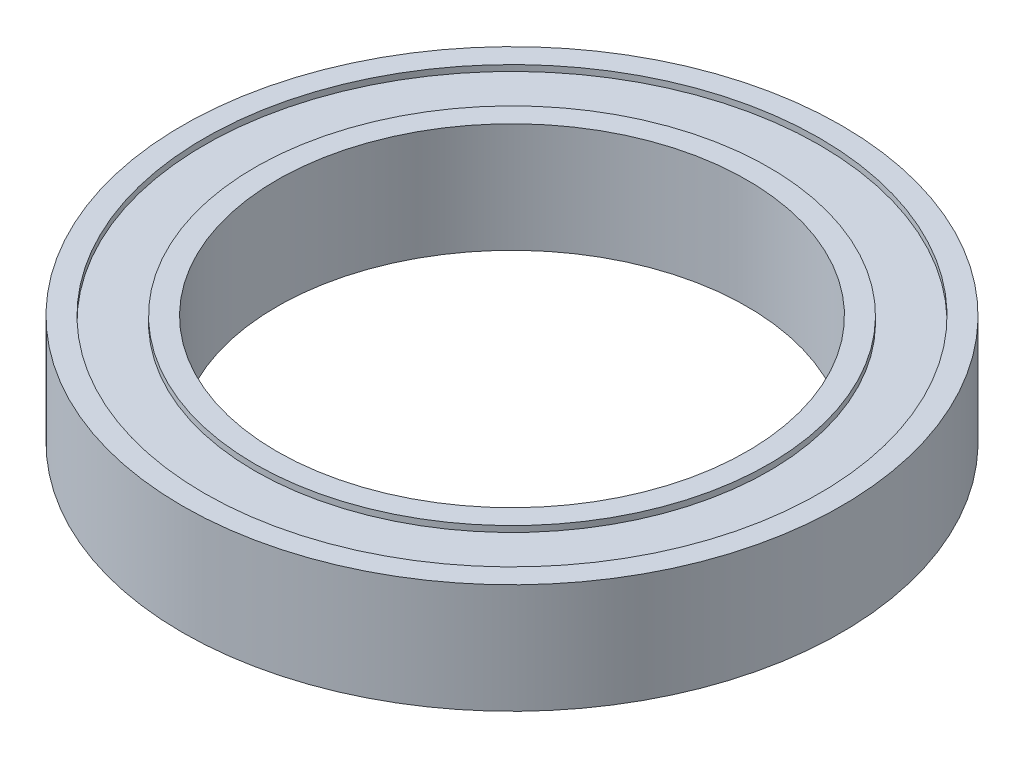
ISO-10303-21;
HEADER;
FILE_DESCRIPTION(('STEP AP214'),'2;1');
FILE_NAME('part.step','',(''),(''),'','','');
FILE_SCHEMA(('AUTOMOTIVE_DESIGN { 1 0 10303 214 1 1 1 1 }'));
ENDSEC;
DATA;
#1=APPLICATION_CONTEXT('core data for automotive mechanical design processes');
#2=APPLICATION_PROTOCOL_DEFINITION('international standard','automotive_design',2000,#1);
#3=PRODUCT_CONTEXT('',#1,'mechanical');
#4=PRODUCT('Part','Part','',(#3));
#5=PRODUCT_RELATED_PRODUCT_CATEGORY('part','',(#4));
#6=PRODUCT_DEFINITION_FORMATION('','',#4);
#7=PRODUCT_DEFINITION_CONTEXT('part definition',#1,'design');
#8=PRODUCT_DEFINITION('design','',#6,#7);
#9=PRODUCT_DEFINITION_SHAPE('','',#8);
#10=(LENGTH_UNIT() NAMED_UNIT(*) SI_UNIT(.MILLI.,.METRE.));
#11=(NAMED_UNIT(*) PLANE_ANGLE_UNIT() SI_UNIT($,.RADIAN.));
#12=(NAMED_UNIT(*) SI_UNIT($,.STERADIAN.) SOLID_ANGLE_UNIT());
#13=UNCERTAINTY_MEASURE_WITH_UNIT(LENGTH_MEASURE(1.E-05),#10,'distance_accuracy_value','');
#14=(GEOMETRIC_REPRESENTATION_CONTEXT(3) GLOBAL_UNCERTAINTY_ASSIGNED_CONTEXT((#13)) GLOBAL_UNIT_ASSIGNED_CONTEXT((#10,
#11,#12)) REPRESENTATION_CONTEXT('',''));
#15=CARTESIAN_POINT('',(0.,0.,0.));
#16=DIRECTION('',(0.,0.,1.));
#17=DIRECTION('',(1.,0.,0.));
#18=AXIS2_PLACEMENT_3D('',#15,#16,#17);
#19=CARTESIAN_POINT('',(0.,-3.4925,0.));
#20=DIRECTION('',(0.,1.,0.));
#21=DIRECTION('',(0.,0.,1.));
#22=AXIS2_PLACEMENT_3D('',#19,#20,#21);
#23=CYLINDRICAL_SURFACE('',#22,16.383);
#24=CARTESIAN_POINT('',(0.,-3.4925,0.));
#25=DIRECTION('',(0.,1.,0.));
#26=DIRECTION('',(0.,0.,1.));
#27=AXIS2_PLACEMENT_3D('',#24,#25,#26);
#28=CIRCLE('',#27,16.383);
#29=CARTESIAN_POINT('',(0.,-3.4925,16.383));
#30=VERTEX_POINT('',#29);
#31=EDGE_CURVE('E55',#30,#30,#28,.T.);
#32=ORIENTED_EDGE('',*,*,#31,.T.);
#33=EDGE_LOOP('',(#32));
#34=FACE_BOUND('',#33,.T.);
#35=CARTESIAN_POINT('',(0.,-3.1115,0.));
#36=DIRECTION('',(0.,1.,0.));
#37=DIRECTION('',(0.,0.,1.));
#38=AXIS2_PLACEMENT_3D('',#35,#36,#37);
#39=CIRCLE('',#38,16.383);
#40=CARTESIAN_POINT('',(0.,-3.1115,16.383));
#41=VERTEX_POINT('',#40);
#42=EDGE_CURVE('E74',#41,#41,#39,.T.);
#43=ORIENTED_EDGE('',*,*,#42,.F.);
#44=EDGE_LOOP('',(#43));
#45=FACE_BOUND('',#44,.T.);
#46=ADVANCED_FACE('F48',(#34,#45),#23,.T.);
#47=CARTESIAN_POINT('',(0.,-3.4925,0.));
#48=DIRECTION('',(0.,1.,0.));
#49=DIRECTION('',(0.,0.,1.));
#50=AXIS2_PLACEMENT_3D('',#47,#48,#49);
#51=CYLINDRICAL_SURFACE('',#50,14.986);
#52=CARTESIAN_POINT('',(0.,-3.4925,0.));
#53=DIRECTION('',(0.,1.,0.));
#54=DIRECTION('',(0.,0.,1.));
#55=AXIS2_PLACEMENT_3D('',#52,#53,#54);
#56=CIRCLE('',#55,14.986);
#57=CARTESIAN_POINT('',(0.,-3.4925,14.986));
#58=VERTEX_POINT('',#57);
#59=EDGE_CURVE('E59',#58,#58,#56,.T.);
#60=ORIENTED_EDGE('',*,*,#59,.F.);
#61=EDGE_LOOP('',(#60));
#62=FACE_BOUND('',#61,.T.);
#63=CARTESIAN_POINT('',(0.,3.4925,0.));
#64=DIRECTION('',(0.,1.,0.));
#65=DIRECTION('',(0.,0.,1.));
#66=AXIS2_PLACEMENT_3D('',#63,#64,#65);
#67=CIRCLE('',#66,14.986);
#68=CARTESIAN_POINT('',(0.,3.4925,14.986));
#69=VERTEX_POINT('',#68);
#70=EDGE_CURVE('E68',#69,#69,#67,.T.);
#71=ORIENTED_EDGE('',*,*,#70,.T.);
#72=EDGE_LOOP('',(#71));
#73=FACE_BOUND('',#72,.T.);
#74=ADVANCED_FACE('F50',(#62,#73),#51,.F.);
#75=CARTESIAN_POINT('',(0.,3.1115,0.));
#76=DIRECTION('',(0.,1.,0.));
#77=DIRECTION('',(0.,0.,1.));
#78=AXIS2_PLACEMENT_3D('',#75,#76,#77);
#79=CIRCLE('',#78,16.383);
#80=CARTESIAN_POINT('',(0.,3.1115,16.383));
#81=VERTEX_POINT('',#80);
#82=EDGE_CURVE('E11',#81,#81,#79,.F.);
#83=ORIENTED_EDGE('',*,*,#82,.F.);
#84=EDGE_LOOP('',(#83));
#85=FACE_BOUND('',#84,.T.);
#86=CARTESIAN_POINT('',(0.,3.4925,0.));
#87=DIRECTION('',(0.,1.,0.));
#88=DIRECTION('',(0.,0.,1.));
#89=AXIS2_PLACEMENT_3D('',#86,#87,#88);
#90=CIRCLE('',#89,16.383);
#91=CARTESIAN_POINT('',(0.,3.4925,16.383));
#92=VERTEX_POINT('',#91);
#93=EDGE_CURVE('E63',#92,#92,#90,.T.);
#94=ORIENTED_EDGE('',*,*,#93,.F.);
#95=EDGE_LOOP('',(#94));
#96=FACE_BOUND('',#95,.T.);
#97=ADVANCED_FACE('F116',(#85,#96),#23,.T.);
#98=CARTESIAN_POINT('',(0.,-3.4925,0.));
#99=DIRECTION('',(0.,1.,0.));
#100=DIRECTION('',(0.,0.,1.));
#101=AXIS2_PLACEMENT_3D('',#98,#99,#100);
#102=PLANE('',#101);
#103=ORIENTED_EDGE('',*,*,#59,.T.);
#104=EDGE_LOOP('',(#103));
#105=FACE_BOUND('',#104,.T.);
#106=ORIENTED_EDGE('',*,*,#31,.F.);
#107=EDGE_LOOP('',(#106));
#108=FACE_BOUND('',#107,.T.);
#109=ADVANCED_FACE('F124',(#105,#108),#102,.F.);
#110=CARTESIAN_POINT('',(0.,3.4925,0.));
#111=DIRECTION('',(0.,1.,0.));
#112=DIRECTION('',(0.,0.,1.));
#113=AXIS2_PLACEMENT_3D('',#110,#111,#112);
#114=PLANE('',#113);
#115=ORIENTED_EDGE('',*,*,#70,.F.);
#116=EDGE_LOOP('',(#115));
#117=FACE_BOUND('',#116,.T.);
#118=ORIENTED_EDGE('',*,*,#93,.T.);
#119=EDGE_LOOP('',(#118));
#120=FACE_BOUND('',#119,.T.);
#121=ADVANCED_FACE('F129',(#117,#120),#114,.T.);
#122=CARTESIAN_POINT('',(0.,-3.1115,0.));
#123=DIRECTION('',(0.,1.,0.));
#124=DIRECTION('',(0.,0.,1.));
#125=AXIS2_PLACEMENT_3D('',#122,#123,#124);
#126=PLANE('',#125);
#127=ORIENTED_EDGE('',*,*,#42,.T.);
#128=EDGE_LOOP('',(#127));
#129=FACE_BOUND('',#128,.T.);
#130=CARTESIAN_POINT('',(0.,-3.1115,0.));
#131=DIRECTION('',(0.,1.,0.));
#132=DIRECTION('',(0.,0.,1.));
#133=AXIS2_PLACEMENT_3D('',#130,#131,#132);
#134=CIRCLE('',#133,19.6088);
#135=CARTESIAN_POINT('',(0.,-3.1115,19.6088));
#136=VERTEX_POINT('',#135);
#137=EDGE_CURVE('E71',#136,#136,#134,.T.);
#138=ORIENTED_EDGE('',*,*,#137,.F.);
#139=EDGE_LOOP('',(#138));
#140=FACE_BOUND('',#139,.T.);
#141=ADVANCED_FACE('F135',(#129,#140),#126,.F.);
#142=CARTESIAN_POINT('',(0.,3.1115,0.));
#143=DIRECTION('',(0.,1.,0.));
#144=DIRECTION('',(0.,0.,1.));
#145=AXIS2_PLACEMENT_3D('',#142,#143,#144);
#146=PLANE('',#145);
#147=ORIENTED_EDGE('',*,*,#82,.T.);
#148=EDGE_LOOP('',(#147));
#149=FACE_BOUND('',#148,.T.);
#150=CARTESIAN_POINT('',(0.,3.1115,0.));
#151=DIRECTION('',(0.,1.,0.));
#152=DIRECTION('',(0.,0.,1.));
#153=AXIS2_PLACEMENT_3D('',#150,#151,#152);
#154=CIRCLE('',#153,19.6088);
#155=CARTESIAN_POINT('',(0.,3.1115,19.6088));
#156=VERTEX_POINT('',#155);
#157=EDGE_CURVE('E77',#156,#156,#154,.T.);
#158=ORIENTED_EDGE('',*,*,#157,.T.);
#159=EDGE_LOOP('',(#158));
#160=FACE_BOUND('',#159,.T.);
#161=ADVANCED_FACE('F141',(#149,#160),#146,.T.);
#162=CARTESIAN_POINT('',(0.,-3.4925,0.));
#163=DIRECTION('',(0.,1.,0.));
#164=DIRECTION('',(0.,0.,1.));
#165=AXIS2_PLACEMENT_3D('',#162,#163,#164);
#166=CYLINDRICAL_SURFACE('',#165,19.6088);
#167=CARTESIAN_POINT('',(0.,-3.4925,0.));
#168=DIRECTION('',(0.,1.,0.));
#169=DIRECTION('',(0.,0.,1.));
#170=AXIS2_PLACEMENT_3D('',#167,#168,#169);
#171=CIRCLE('',#170,19.6088);
#172=CARTESIAN_POINT('',(0.,-3.4925,19.6088));
#173=VERTEX_POINT('',#172);
#174=EDGE_CURVE('E83',#173,#173,#171,.T.);
#175=ORIENTED_EDGE('',*,*,#174,.F.);
#176=EDGE_LOOP('',(#175));
#177=FACE_BOUND('',#176,.T.);
#178=ORIENTED_EDGE('',*,*,#137,.T.);
#179=EDGE_LOOP('',(#178));
#180=FACE_BOUND('',#179,.T.);
#181=ADVANCED_FACE('F112',(#177,#180),#166,.F.);
#182=ORIENTED_EDGE('',*,*,#157,.F.);
#183=EDGE_LOOP('',(#182));
#184=FACE_BOUND('',#183,.T.);
#185=CARTESIAN_POINT('',(0.,3.4925,0.));
#186=DIRECTION('',(0.,1.,0.));
#187=DIRECTION('',(0.,0.,1.));
#188=AXIS2_PLACEMENT_3D('',#185,#186,#187);
#189=CIRCLE('',#188,19.6088);
#190=CARTESIAN_POINT('',(0.,3.4925,19.6088));
#191=VERTEX_POINT('',#190);
#192=EDGE_CURVE('E89',#191,#191,#189,.T.);
#193=ORIENTED_EDGE('',*,*,#192,.T.);
#194=EDGE_LOOP('',(#193));
#195=FACE_BOUND('',#194,.T.);
#196=ADVANCED_FACE('F93',(#184,#195),#166,.F.);
#197=CARTESIAN_POINT('',(0.,-3.4925,0.));
#198=DIRECTION('',(0.,1.,0.));
#199=DIRECTION('',(0.,0.,1.));
#200=AXIS2_PLACEMENT_3D('',#197,#198,#199);
#201=CYLINDRICAL_SURFACE('',#200,21.0058);
#202=CARTESIAN_POINT('',(0.,-3.4925,0.));
#203=DIRECTION('',(0.,1.,0.));
#204=DIRECTION('',(0.,0.,1.));
#205=AXIS2_PLACEMENT_3D('',#202,#203,#204);
#206=CIRCLE('',#205,21.0058);
#207=CARTESIAN_POINT('',(0.,-3.4925,21.0058));
#208=VERTEX_POINT('',#207);
#209=EDGE_CURVE('E80',#208,#208,#206,.T.);
#210=ORIENTED_EDGE('',*,*,#209,.T.);
#211=EDGE_LOOP('',(#210));
#212=FACE_BOUND('',#211,.T.);
#213=CARTESIAN_POINT('',(0.,3.4925,0.));
#214=DIRECTION('',(0.,1.,0.));
#215=DIRECTION('',(0.,0.,1.));
#216=AXIS2_PLACEMENT_3D('',#213,#214,#215);
#217=CIRCLE('',#216,21.0058);
#218=CARTESIAN_POINT('',(0.,3.4925,21.0058));
#219=VERTEX_POINT('',#218);
#220=EDGE_CURVE('E86',#219,#219,#217,.T.);
#221=ORIENTED_EDGE('',*,*,#220,.F.);
#222=EDGE_LOOP('',(#221));
#223=FACE_BOUND('',#222,.T.);
#224=ADVANCED_FACE('F102',(#212,#223),#201,.T.);
#225=CARTESIAN_POINT('',(0.,-3.4925,0.));
#226=DIRECTION('',(0.,1.,0.));
#227=DIRECTION('',(0.,0.,1.));
#228=AXIS2_PLACEMENT_3D('',#225,#226,#227);
#229=PLANE('',#228);
#230=ORIENTED_EDGE('',*,*,#174,.T.);
#231=EDGE_LOOP('',(#230));
#232=FACE_BOUND('',#231,.T.);
#233=ORIENTED_EDGE('',*,*,#209,.F.);
#234=EDGE_LOOP('',(#233));
#235=FACE_BOUND('',#234,.T.);
#236=ADVANCED_FACE('F98',(#232,#235),#229,.F.);
#237=CARTESIAN_POINT('',(0.,3.4925,0.));
#238=DIRECTION('',(0.,1.,0.));
#239=DIRECTION('',(0.,0.,1.));
#240=AXIS2_PLACEMENT_3D('',#237,#238,#239);
#241=PLANE('',#240);
#242=ORIENTED_EDGE('',*,*,#192,.F.);
#243=EDGE_LOOP('',(#242));
#244=FACE_BOUND('',#243,.T.);
#245=ORIENTED_EDGE('',*,*,#220,.T.);
#246=EDGE_LOOP('',(#245));
#247=FACE_BOUND('',#246,.T.);
#248=ADVANCED_FACE('F95',(#244,#247),#241,.T.);
#249=CLOSED_SHELL('',(#46,#74,#97,#109,#121,#141,#161,#181,#196,#224,#236,#248));
#250=MANIFOLD_SOLID_BREP('B2',#249);
#251=ADVANCED_BREP_SHAPE_REPRESENTATION('',(#18,#250),#14);
#252=SHAPE_DEFINITION_REPRESENTATION(#9,#251);
ENDSEC;
END-ISO-10303-21;
